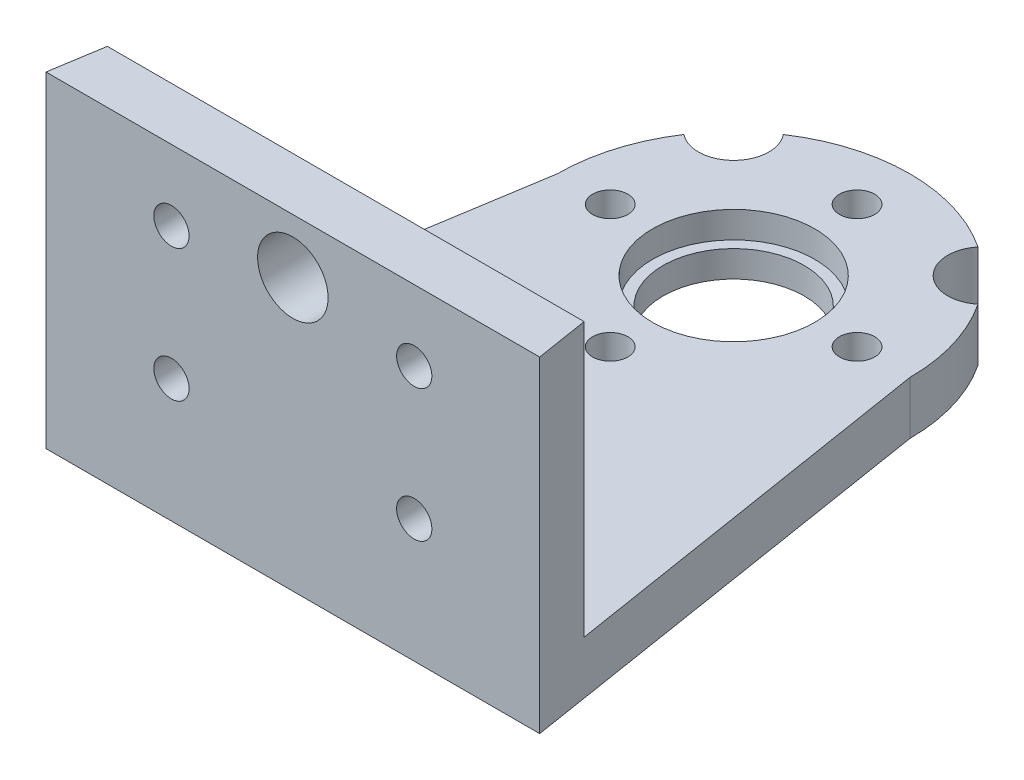
ISO-10303-21;
HEADER;
FILE_DESCRIPTION(('STEP AP214'),'2;1');
FILE_NAME('part.step','',(''),(''),'','','');
FILE_SCHEMA(('AUTOMOTIVE_DESIGN { 1 0 10303 214 1 1 1 1 }'));
ENDSEC;
DATA;
#1=APPLICATION_CONTEXT('core data for automotive mechanical design processes');
#2=APPLICATION_PROTOCOL_DEFINITION('international standard','automotive_design',2000,#1);
#3=PRODUCT_CONTEXT('',#1,'mechanical');
#4=PRODUCT('Part','Part','',(#3));
#5=PRODUCT_RELATED_PRODUCT_CATEGORY('part','',(#4));
#6=PRODUCT_DEFINITION_FORMATION('','',#4);
#7=PRODUCT_DEFINITION_CONTEXT('part definition',#1,'design');
#8=PRODUCT_DEFINITION('design','',#6,#7);
#9=PRODUCT_DEFINITION_SHAPE('','',#8);
#10=(LENGTH_UNIT() NAMED_UNIT(*) SI_UNIT(.MILLI.,.METRE.));
#11=(NAMED_UNIT(*) PLANE_ANGLE_UNIT() SI_UNIT($,.RADIAN.));
#12=(NAMED_UNIT(*) SI_UNIT($,.STERADIAN.) SOLID_ANGLE_UNIT());
#13=UNCERTAINTY_MEASURE_WITH_UNIT(LENGTH_MEASURE(1.E-05),#10,'distance_accuracy_value','');
#14=(GEOMETRIC_REPRESENTATION_CONTEXT(3) GLOBAL_UNCERTAINTY_ASSIGNED_CONTEXT((#13)) GLOBAL_UNIT_ASSIGNED_CONTEXT((#10,
#11,#12)) REPRESENTATION_CONTEXT('',''));
#15=CARTESIAN_POINT('',(0.,0.,0.));
#16=DIRECTION('',(0.,0.,1.));
#17=DIRECTION('',(1.,0.,0.));
#18=AXIS2_PLACEMENT_3D('',#15,#16,#17);
#19=CARTESIAN_POINT('',(0.,3.,0.));
#20=DIRECTION('',(0.,-1.,0.));
#21=DIRECTION('',(0.,0.,-1.));
#22=AXIS2_PLACEMENT_3D('',#19,#20,#21);
#23=CYLINDRICAL_SURFACE('',#22,10.);
#24=CARTESIAN_POINT('',(0.,0.,0.));
#25=DIRECTION('',(0.,1.,0.));
#26=DIRECTION('',(0.,0.,-1.));
#27=AXIS2_PLACEMENT_3D('',#24,#25,#26);
#28=CIRCLE('',#27,10.);
#29=CARTESIAN_POINT('',(10.,0.,0.));
#30=VERTEX_POINT('',#29);
#31=CARTESIAN_POINT('',(8.33677118357518,0.,-5.52252172768116));
#32=VERTEX_POINT('',#31);
#33=EDGE_CURVE('E318',#30,#32,#28,.T.);
#34=ORIENTED_EDGE('',*,*,#33,.T.);
#35=DIRECTION('',(0.,1.,0.));
#36=VECTOR('',#35,1.);
#37=CARTESIAN_POINT('',(8.33677118357519,-2.,-5.52252172768115));
#38=LINE('',#37,#36);
#39=CARTESIAN_POINT('',(8.33677118357519,3.,-5.52252172768115));
#40=VERTEX_POINT('',#39);
#41=EDGE_CURVE('E48',#32,#40,#38,.T.);
#42=ORIENTED_EDGE('',*,*,#41,.T.);
#43=CARTESIAN_POINT('',(0.,3.,0.));
#44=DIRECTION('',(0.,1.,0.));
#45=DIRECTION('',(0.,0.,-1.));
#46=AXIS2_PLACEMENT_3D('',#43,#44,#45);
#47=CIRCLE('',#46,10.);
#48=CARTESIAN_POINT('',(10.,3.,0.));
#49=VERTEX_POINT('',#48);
#50=EDGE_CURVE('E122',#49,#40,#47,.T.);
#51=ORIENTED_EDGE('',*,*,#50,.F.);
#52=DIRECTION('',(0.,-1.,0.));
#53=VECTOR('',#52,1.);
#54=CARTESIAN_POINT('',(10.,3.,0.));
#55=LINE('',#54,#53);
#56=EDGE_CURVE('E146',#49,#30,#55,.T.);
#57=ORIENTED_EDGE('',*,*,#56,.T.);
#58=EDGE_LOOP('',(#34,#42,#51,#57));
#59=FACE_BOUND('',#58,.T.);
#60=ADVANCED_FACE('F34',(#59),#23,.T.);
#61=CARTESIAN_POINT('',(5.52252172768112,3.,-8.33677118357521));
#62=VERTEX_POINT('',#61);
#63=CARTESIAN_POINT('',(-5.52252172768112,3.,-8.33677118357521));
#64=VERTEX_POINT('',#63);
#65=EDGE_CURVE('E119',#62,#64,#47,.T.);
#66=ORIENTED_EDGE('',*,*,#65,.F.);
#67=DIRECTION('',(0.,1.,0.));
#68=VECTOR('',#67,1.);
#69=CARTESIAN_POINT('',(5.52252172768112,-2.,-8.33677118357521));
#70=LINE('',#69,#68);
#71=CARTESIAN_POINT('',(5.52252172768113,0.,-8.3367711835752));
#72=VERTEX_POINT('',#71);
#73=EDGE_CURVE('E109',#62,#72,#70,.F.);
#74=ORIENTED_EDGE('',*,*,#73,.T.);
#75=CARTESIAN_POINT('',(-5.52252172768113,0.,-8.3367711835752));
#76=VERTEX_POINT('',#75);
#77=EDGE_CURVE('E56',#72,#76,#28,.T.);
#78=ORIENTED_EDGE('',*,*,#77,.T.);
#79=DIRECTION('',(0.,1.,0.));
#80=VECTOR('',#79,1.);
#81=CARTESIAN_POINT('',(-5.52252172768112,-2.,-8.33677118357521));
#82=LINE('',#81,#80);
#83=EDGE_CURVE('E126',#76,#64,#82,.T.);
#84=ORIENTED_EDGE('',*,*,#83,.T.);
#85=EDGE_LOOP('',(#66,#74,#78,#84));
#86=FACE_BOUND('',#85,.T.);
#87=ADVANCED_FACE('F125',(#86),#23,.T.);
#88=CARTESIAN_POINT('',(0.,-10.,0.));
#89=DIRECTION('',(0.,1.,0.));
#90=DIRECTION('',(0.,0.,1.));
#91=AXIS2_PLACEMENT_3D('',#88,#89,#90);
#92=CYLINDRICAL_SURFACE('',#91,4.);
#93=CARTESIAN_POINT('',(0.,0.,0.));
#94=DIRECTION('',(0.,-1.,0.));
#95=DIRECTION('',(0.,0.,-1.));
#96=AXIS2_PLACEMENT_3D('',#93,#94,#95);
#97=CIRCLE('',#96,4.);
#98=CARTESIAN_POINT('',(0.,0.,-4.));
#99=VERTEX_POINT('',#98);
#100=EDGE_CURVE('E143',#99,#99,#97,.T.);
#101=ORIENTED_EDGE('',*,*,#100,.T.);
#102=EDGE_LOOP('',(#101));
#103=FACE_BOUND('',#102,.T.);
#104=CARTESIAN_POINT('',(0.,1.5,0.));
#105=DIRECTION('',(0.,1.,0.));
#106=DIRECTION('',(0.,0.,1.));
#107=AXIS2_PLACEMENT_3D('',#104,#105,#106);
#108=CIRCLE('',#107,4.);
#109=CARTESIAN_POINT('',(0.,1.5,4.));
#110=VERTEX_POINT('',#109);
#111=EDGE_CURVE('E152',#110,#110,#108,.F.);
#112=ORIENTED_EDGE('',*,*,#111,.F.);
#113=EDGE_LOOP('',(#112));
#114=FACE_BOUND('',#113,.T.);
#115=ADVANCED_FACE('F191',(#103,#114),#92,.F.);
#116=CARTESIAN_POINT('',(0.,3.,0.));
#117=DIRECTION('',(0.,-1.,0.));
#118=DIRECTION('',(0.,0.,-1.));
#119=AXIS2_PLACEMENT_3D('',#116,#117,#118);
#120=PLANE('',#119);
#121=CARTESIAN_POINT('',(0.,3.,0.));
#122=DIRECTION('',(0.,1.,0.));
#123=DIRECTION('',(0.,0.,1.));
#124=AXIS2_PLACEMENT_3D('',#121,#122,#123);
#125=CIRCLE('',#124,4.6);
#126=CARTESIAN_POINT('',(0.,3.,4.6));
#127=VERTEX_POINT('',#126);
#128=EDGE_CURVE('E258',#127,#127,#125,.T.);
#129=ORIENTED_EDGE('',*,*,#128,.F.);
#130=EDGE_LOOP('',(#129));
#131=FACE_BOUND('',#130,.T.);
#132=CARTESIAN_POINT('',(0.,3.,7.));
#133=DIRECTION('',(0.,1.,0.));
#134=DIRECTION('',(0.,0.,1.));
#135=AXIS2_PLACEMENT_3D('',#132,#133,#134);
#136=CIRCLE('',#135,1.);
#137=CARTESIAN_POINT('',(0.,3.,8.));
#138=VERTEX_POINT('',#137);
#139=EDGE_CURVE('E133',#138,#138,#136,.T.);
#140=ORIENTED_EDGE('',*,*,#139,.F.);
#141=EDGE_LOOP('',(#140));
#142=FACE_BOUND('',#141,.T.);
#143=CARTESIAN_POINT('',(-7.,3.,0.));
#144=DIRECTION('',(0.,1.,0.));
#145=DIRECTION('',(0.,0.,1.));
#146=AXIS2_PLACEMENT_3D('',#143,#144,#145);
#147=CIRCLE('',#146,1.);
#148=CARTESIAN_POINT('',(-7.,3.,0.999999999999975));
#149=VERTEX_POINT('',#148);
#150=EDGE_CURVE('E171',#149,#149,#147,.T.);
#151=ORIENTED_EDGE('',*,*,#150,.F.);
#152=EDGE_LOOP('',(#151));
#153=FACE_BOUND('',#152,.T.);
#154=CARTESIAN_POINT('',(0.,3.,-7.));
#155=DIRECTION('',(0.,1.,0.));
#156=DIRECTION('',(0.,0.,1.));
#157=AXIS2_PLACEMENT_3D('',#154,#155,#156);
#158=CIRCLE('',#157,1.);
#159=CARTESIAN_POINT('',(0.,3.,-6.));
#160=VERTEX_POINT('',#159);
#161=EDGE_CURVE('E163',#160,#160,#158,.T.);
#162=ORIENTED_EDGE('',*,*,#161,.F.);
#163=EDGE_LOOP('',(#162));
#164=FACE_BOUND('',#163,.T.);
#165=CARTESIAN_POINT('',(7.,3.,0.));
#166=DIRECTION('',(0.,1.,0.));
#167=DIRECTION('',(0.,0.,1.));
#168=AXIS2_PLACEMENT_3D('',#165,#166,#167);
#169=CIRCLE('',#168,1.);
#170=CARTESIAN_POINT('',(7.,3.,1.00000000000007));
#171=VERTEX_POINT('',#170);
#172=EDGE_CURVE('E164',#171,#171,#169,.T.);
#173=ORIENTED_EDGE('',*,*,#172,.F.);
#174=EDGE_LOOP('',(#173));
#175=FACE_BOUND('',#174,.T.);
#176=ORIENTED_EDGE('',*,*,#50,.T.);
#177=CARTESIAN_POINT('',(7.07106781186546,3.,-7.07106781186549));
#178=DIRECTION('',(0.,1.,0.));
#179=DIRECTION('',(0.,0.,-1.));
#180=AXIS2_PLACEMENT_3D('',#177,#178,#179);
#181=CIRCLE('',#180,2.);
#182=EDGE_CURVE('E112',#62,#40,#181,.T.);
#183=ORIENTED_EDGE('',*,*,#182,.F.);
#184=ORIENTED_EDGE('',*,*,#65,.T.);
#185=CARTESIAN_POINT('',(-7.07106781186546,3.,-7.07106781186549));
#186=DIRECTION('',(0.,1.,0.));
#187=DIRECTION('',(0.,0.,1.));
#188=AXIS2_PLACEMENT_3D('',#185,#186,#187);
#189=CIRCLE('',#188,2.);
#190=CARTESIAN_POINT('',(-8.33677118357519,3.,-5.52252172768115));
#191=VERTEX_POINT('',#190);
#192=EDGE_CURVE('E240',#191,#64,#189,.T.);
#193=ORIENTED_EDGE('',*,*,#192,.F.);
#194=CARTESIAN_POINT('',(-10.,3.,0.));
#195=VERTEX_POINT('',#194);
#196=EDGE_CURVE('E127',#191,#195,#47,.T.);
#197=ORIENTED_EDGE('',*,*,#196,.T.);
#198=DIRECTION('',(-0.157990501106673,0.,0.987440631916705));
#199=VECTOR('',#198,1.);
#200=CARTESIAN_POINT('',(-10.,3.,0.));
#201=LINE('',#200,#199);
#202=CARTESIAN_POINT('',(-13.52,3.,22.));
#203=VERTEX_POINT('',#202);
#204=EDGE_CURVE('E129',#195,#203,#201,.T.);
#205=ORIENTED_EDGE('',*,*,#204,.T.);
#206=DIRECTION('',(-1.,0.,0.));
#207=VECTOR('',#206,1.);
#208=CARTESIAN_POINT('',(-13.52,3.,22.));
#209=LINE('',#208,#207);
#210=CARTESIAN_POINT('',(13.52,3.,22.));
#211=VERTEX_POINT('',#210);
#212=EDGE_CURVE('E147',#211,#203,#209,.T.);
#213=ORIENTED_EDGE('',*,*,#212,.F.);
#214=DIRECTION('',(-0.157990501106673,0.,-0.987440631916705));
#215=VECTOR('',#214,1.);
#216=CARTESIAN_POINT('',(10.,3.,0.));
#217=LINE('',#216,#215);
#218=EDGE_CURVE('E142',#211,#49,#217,.T.);
#219=ORIENTED_EDGE('',*,*,#218,.T.);
#220=EDGE_LOOP('',(#176,#183,#184,#193,#197,#205,#213,#219));
#221=FACE_BOUND('',#220,.T.);
#222=ADVANCED_FACE('F117',(#131,#142,#153,#164,#175,#221),#120,.F.);
#223=ORIENTED_EDGE('',*,*,#196,.F.);
#224=DIRECTION('',(0.,1.,0.));
#225=VECTOR('',#224,1.);
#226=CARTESIAN_POINT('',(-8.33677118357519,-2.,-5.52252172768115));
#227=LINE('',#226,#225);
#228=CARTESIAN_POINT('',(-8.33677118357518,0.,-5.52252172768116));
#229=VERTEX_POINT('',#228);
#230=EDGE_CURVE('E235',#191,#229,#227,.F.);
#231=ORIENTED_EDGE('',*,*,#230,.T.);
#232=CARTESIAN_POINT('',(-10.,0.,0.));
#233=VERTEX_POINT('',#232);
#234=EDGE_CURVE('E183',#229,#233,#28,.T.);
#235=ORIENTED_EDGE('',*,*,#234,.T.);
#236=DIRECTION('',(0.,-1.,0.));
#237=VECTOR('',#236,1.);
#238=CARTESIAN_POINT('',(-10.,3.,0.));
#239=LINE('',#238,#237);
#240=EDGE_CURVE('E238',#195,#233,#239,.T.);
#241=ORIENTED_EDGE('',*,*,#240,.F.);
#242=EDGE_LOOP('',(#223,#231,#235,#241));
#243=FACE_BOUND('',#242,.T.);
#244=ADVANCED_FACE('F36',(#243),#23,.T.);
#245=CARTESIAN_POINT('',(-10.,3.,0.));
#246=DIRECTION('',(0.987440631916705,0.,0.157990501106673));
#247=DIRECTION('',(0.157990501106673,0.,-0.987440631916705));
#248=AXIS2_PLACEMENT_3D('',#245,#246,#247);
#249=PLANE('',#248);
#250=DIRECTION('',(-0.157990501106673,0.,0.987440631916705));
#251=VECTOR('',#250,1.);
#252=CARTESIAN_POINT('',(-10.,0.,0.));
#253=LINE('',#252,#251);
#254=CARTESIAN_POINT('',(-14.,0.,25.));
#255=VERTEX_POINT('',#254);
#256=EDGE_CURVE('E320',#233,#255,#253,.T.);
#257=ORIENTED_EDGE('',*,*,#256,.T.);
#258=DIRECTION('',(0.,-1.,0.));
#259=VECTOR('',#258,1.);
#260=CARTESIAN_POINT('',(-14.,3.,25.));
#261=LINE('',#260,#259);
#262=CARTESIAN_POINT('',(-14.,18.5,25.));
#263=VERTEX_POINT('',#262);
#264=EDGE_CURVE('E329',#263,#255,#261,.T.);
#265=ORIENTED_EDGE('',*,*,#264,.F.);
#266=DIRECTION('',(-0.157990501106673,0.,0.987440631916705));
#267=VECTOR('',#266,1.);
#268=CARTESIAN_POINT('',(-13.52,18.5,22.));
#269=LINE('',#268,#267);
#270=CARTESIAN_POINT('',(-13.52,18.5,22.));
#271=VERTEX_POINT('',#270);
#272=EDGE_CURVE('E151',#271,#263,#269,.T.);
#273=ORIENTED_EDGE('',*,*,#272,.F.);
#274=DIRECTION('',(0.,-1.,0.));
#275=VECTOR('',#274,1.);
#276=CARTESIAN_POINT('',(-13.52,18.5,22.));
#277=LINE('',#276,#275);
#278=EDGE_CURVE('E153',#271,#203,#277,.T.);
#279=ORIENTED_EDGE('',*,*,#278,.T.);
#280=ORIENTED_EDGE('',*,*,#204,.F.);
#281=ORIENTED_EDGE('',*,*,#240,.T.);
#282=EDGE_LOOP('',(#257,#265,#273,#279,#280,#281));
#283=FACE_BOUND('',#282,.T.);
#284=ADVANCED_FACE('F225',(#283),#249,.F.);
#285=CARTESIAN_POINT('',(-14.,3.,25.));
#286=DIRECTION('',(0.,0.,-1.));
#287=DIRECTION('',(-1.,0.,0.));
#288=AXIS2_PLACEMENT_3D('',#285,#286,#287);
#289=PLANE('',#288);
#290=CARTESIAN_POINT('',(-1.49508972665386E-13,15.4000000000021,25.));
#291=DIRECTION('',(0.,0.,-1.));
#292=DIRECTION('',(-1.,0.,0.));
#293=AXIS2_PLACEMENT_3D('',#290,#291,#292);
#294=CIRCLE('',#293,2.);
#295=CARTESIAN_POINT('',(-2.00000000000015,15.4000000000021,25.));
#296=VERTEX_POINT('',#295);
#297=EDGE_CURVE('E287',#296,#296,#294,.T.);
#298=ORIENTED_EDGE('',*,*,#297,.T.);
#299=EDGE_LOOP('',(#298));
#300=FACE_BOUND('',#299,.T.);
#301=CARTESIAN_POINT('',(6.88499999999998,7.,25.));
#302=DIRECTION('',(0.,0.,-1.));
#303=DIRECTION('',(-1.,0.,0.));
#304=AXIS2_PLACEMENT_3D('',#301,#302,#303);
#305=CIRCLE('',#304,1.);
#306=CARTESIAN_POINT('',(5.88499999999998,7.,25.));
#307=VERTEX_POINT('',#306);
#308=EDGE_CURVE('E273',#307,#307,#305,.T.);
#309=ORIENTED_EDGE('',*,*,#308,.T.);
#310=EDGE_LOOP('',(#309));
#311=FACE_BOUND('',#310,.T.);
#312=CARTESIAN_POINT('',(-6.88499999999999,14.5,25.));
#313=DIRECTION('',(0.,0.,-1.));
#314=DIRECTION('',(-1.,0.,0.));
#315=AXIS2_PLACEMENT_3D('',#312,#313,#314);
#316=CIRCLE('',#315,1.);
#317=CARTESIAN_POINT('',(-7.885,14.5,25.));
#318=VERTEX_POINT('',#317);
#319=EDGE_CURVE('E276',#318,#318,#316,.T.);
#320=ORIENTED_EDGE('',*,*,#319,.T.);
#321=EDGE_LOOP('',(#320));
#322=FACE_BOUND('',#321,.T.);
#323=CARTESIAN_POINT('',(6.88500000000001,14.5,25.));
#324=DIRECTION('',(0.,0.,-1.));
#325=DIRECTION('',(-1.,0.,0.));
#326=AXIS2_PLACEMENT_3D('',#323,#324,#325);
#327=CIRCLE('',#326,1.);
#328=CARTESIAN_POINT('',(5.88500000000001,14.5,25.));
#329=VERTEX_POINT('',#328);
#330=EDGE_CURVE('E279',#329,#329,#327,.T.);
#331=ORIENTED_EDGE('',*,*,#330,.T.);
#332=EDGE_LOOP('',(#331));
#333=FACE_BOUND('',#332,.T.);
#334=CARTESIAN_POINT('',(-6.88500000000002,7.,25.));
#335=DIRECTION('',(0.,0.,-1.));
#336=DIRECTION('',(-1.,0.,0.));
#337=AXIS2_PLACEMENT_3D('',#334,#335,#336);
#338=CIRCLE('',#337,1.);
#339=CARTESIAN_POINT('',(-7.88500000000002,7.,25.));
#340=VERTEX_POINT('',#339);
#341=EDGE_CURVE('E123',#340,#340,#338,.T.);
#342=ORIENTED_EDGE('',*,*,#341,.T.);
#343=EDGE_LOOP('',(#342));
#344=FACE_BOUND('',#343,.T.);
#345=DIRECTION('',(1.,0.,0.));
#346=VECTOR('',#345,1.);
#347=CARTESIAN_POINT('',(-14.,0.,25.));
#348=LINE('',#347,#346);
#349=CARTESIAN_POINT('',(14.,0.,25.));
#350=VERTEX_POINT('',#349);
#351=EDGE_CURVE('E321',#255,#350,#348,.T.);
#352=ORIENTED_EDGE('',*,*,#351,.T.);
#353=DIRECTION('',(0.,-1.,0.));
#354=VECTOR('',#353,1.);
#355=CARTESIAN_POINT('',(14.,3.,25.));
#356=LINE('',#355,#354);
#357=CARTESIAN_POINT('',(14.,18.5,25.));
#358=VERTEX_POINT('',#357);
#359=EDGE_CURVE('E316',#358,#350,#356,.T.);
#360=ORIENTED_EDGE('',*,*,#359,.F.);
#361=DIRECTION('',(1.,0.,0.));
#362=VECTOR('',#361,1.);
#363=CARTESIAN_POINT('',(-14.,18.5,25.));
#364=LINE('',#363,#362);
#365=EDGE_CURVE('E251',#263,#358,#364,.T.);
#366=ORIENTED_EDGE('',*,*,#365,.F.);
#367=ORIENTED_EDGE('',*,*,#264,.T.);
#368=EDGE_LOOP('',(#352,#360,#366,#367));
#369=FACE_BOUND('',#368,.T.);
#370=ADVANCED_FACE('F230',(#300,#311,#322,#333,#344,#369),#289,.F.);
#371=CARTESIAN_POINT('',(10.,3.,0.));
#372=DIRECTION('',(-0.987440631916705,0.,0.157990501106673));
#373=DIRECTION('',(0.157990501106673,0.,0.987440631916705));
#374=AXIS2_PLACEMENT_3D('',#371,#372,#373);
#375=PLANE('',#374);
#376=DIRECTION('',(-0.157990501106673,0.,-0.987440631916705));
#377=VECTOR('',#376,1.);
#378=CARTESIAN_POINT('',(10.,0.,0.));
#379=LINE('',#378,#377);
#380=EDGE_CURVE('E130',#350,#30,#379,.T.);
#381=ORIENTED_EDGE('',*,*,#380,.T.);
#382=ORIENTED_EDGE('',*,*,#56,.F.);
#383=ORIENTED_EDGE('',*,*,#218,.F.);
#384=DIRECTION('',(0.,-1.,0.));
#385=VECTOR('',#384,1.);
#386=CARTESIAN_POINT('',(13.52,18.5,22.));
#387=LINE('',#386,#385);
#388=CARTESIAN_POINT('',(13.52,18.5,22.));
#389=VERTEX_POINT('',#388);
#390=EDGE_CURVE('E167',#389,#211,#387,.T.);
#391=ORIENTED_EDGE('',*,*,#390,.F.);
#392=DIRECTION('',(-0.157990501106673,0.,-0.987440631916705));
#393=VECTOR('',#392,1.);
#394=CARTESIAN_POINT('',(14.,18.5,25.));
#395=LINE('',#394,#393);
#396=EDGE_CURVE('E249',#358,#389,#395,.T.);
#397=ORIENTED_EDGE('',*,*,#396,.F.);
#398=ORIENTED_EDGE('',*,*,#359,.T.);
#399=EDGE_LOOP('',(#381,#382,#383,#391,#397,#398));
#400=FACE_BOUND('',#399,.T.);
#401=ADVANCED_FACE('F311',(#400),#375,.F.);
#402=CARTESIAN_POINT('',(0.,0.,0.));
#403=DIRECTION('',(0.,-1.,0.));
#404=DIRECTION('',(0.,0.,-1.));
#405=AXIS2_PLACEMENT_3D('',#402,#403,#404);
#406=PLANE('',#405);
#407=CARTESIAN_POINT('',(7.07106781186546,0.,-7.07106781186549));
#408=DIRECTION('',(0.,-1.,0.));
#409=DIRECTION('',(0.,0.,-1.));
#410=AXIS2_PLACEMENT_3D('',#407,#408,#409);
#411=CIRCLE('',#410,2.);
#412=EDGE_CURVE('E11',#32,#72,#411,.T.);
#413=ORIENTED_EDGE('',*,*,#412,.F.);
#414=ORIENTED_EDGE('',*,*,#33,.F.);
#415=ORIENTED_EDGE('',*,*,#380,.F.);
#416=ORIENTED_EDGE('',*,*,#351,.F.);
#417=ORIENTED_EDGE('',*,*,#256,.F.);
#418=ORIENTED_EDGE('',*,*,#234,.F.);
#419=CARTESIAN_POINT('',(-7.07106781186546,0.,-7.07106781186549));
#420=DIRECTION('',(0.,-1.,0.));
#421=DIRECTION('',(0.,0.,-1.));
#422=AXIS2_PLACEMENT_3D('',#419,#420,#421);
#423=CIRCLE('',#422,2.);
#424=EDGE_CURVE('E42',#76,#229,#423,.T.);
#425=ORIENTED_EDGE('',*,*,#424,.F.);
#426=ORIENTED_EDGE('',*,*,#77,.F.);
#427=EDGE_LOOP('',(#413,#414,#415,#416,#417,#418,#425,#426));
#428=FACE_BOUND('',#427,.T.);
#429=CARTESIAN_POINT('',(7.,0.,0.));
#430=DIRECTION('',(0.,1.,0.));
#431=DIRECTION('',(0.,0.,1.));
#432=AXIS2_PLACEMENT_3D('',#429,#430,#431);
#433=CIRCLE('',#432,1.);
#434=CARTESIAN_POINT('',(7.,0.,1.00000000000007));
#435=VERTEX_POINT('',#434);
#436=EDGE_CURVE('E160',#435,#435,#433,.T.);
#437=ORIENTED_EDGE('',*,*,#436,.T.);
#438=EDGE_LOOP('',(#437));
#439=FACE_BOUND('',#438,.T.);
#440=CARTESIAN_POINT('',(0.,0.,-7.));
#441=DIRECTION('',(0.,1.,0.));
#442=DIRECTION('',(0.,0.,1.));
#443=AXIS2_PLACEMENT_3D('',#440,#441,#442);
#444=CIRCLE('',#443,1.);
#445=CARTESIAN_POINT('',(0.,0.,-6.));
#446=VERTEX_POINT('',#445);
#447=EDGE_CURVE('E168',#446,#446,#444,.T.);
#448=ORIENTED_EDGE('',*,*,#447,.T.);
#449=EDGE_LOOP('',(#448));
#450=FACE_BOUND('',#449,.T.);
#451=CARTESIAN_POINT('',(-7.,0.,0.));
#452=DIRECTION('',(0.,1.,0.));
#453=DIRECTION('',(0.,0.,1.));
#454=AXIS2_PLACEMENT_3D('',#451,#452,#453);
#455=CIRCLE('',#454,1.);
#456=CARTESIAN_POINT('',(-7.,0.,0.999999999999975));
#457=VERTEX_POINT('',#456);
#458=EDGE_CURVE('E174',#457,#457,#455,.T.);
#459=ORIENTED_EDGE('',*,*,#458,.T.);
#460=EDGE_LOOP('',(#459));
#461=FACE_BOUND('',#460,.T.);
#462=CARTESIAN_POINT('',(0.,0.,7.));
#463=DIRECTION('',(0.,1.,0.));
#464=DIRECTION('',(0.,0.,1.));
#465=AXIS2_PLACEMENT_3D('',#462,#463,#464);
#466=CIRCLE('',#465,1.);
#467=CARTESIAN_POINT('',(0.,0.,8.));
#468=VERTEX_POINT('',#467);
#469=EDGE_CURVE('E178',#468,#468,#466,.T.);
#470=ORIENTED_EDGE('',*,*,#469,.T.);
#471=EDGE_LOOP('',(#470));
#472=FACE_BOUND('',#471,.T.);
#473=ORIENTED_EDGE('',*,*,#100,.F.);
#474=EDGE_LOOP('',(#473));
#475=FACE_BOUND('',#474,.T.);
#476=ADVANCED_FACE('F326',(#428,#439,#450,#461,#472,#475),#406,.T.);
#477=CARTESIAN_POINT('',(0.,0.,7.));
#478=DIRECTION('',(0.,1.,0.));
#479=DIRECTION('',(0.,0.,1.));
#480=AXIS2_PLACEMENT_3D('',#477,#478,#479);
#481=CYLINDRICAL_SURFACE('',#480,1.);
#482=ORIENTED_EDGE('',*,*,#469,.F.);
#483=EDGE_LOOP('',(#482));
#484=FACE_BOUND('',#483,.T.);
#485=ORIENTED_EDGE('',*,*,#139,.T.);
#486=EDGE_LOOP('',(#485));
#487=FACE_BOUND('',#486,.T.);
#488=ADVANCED_FACE('F187',(#484,#487),#481,.F.);
#489=CARTESIAN_POINT('',(-7.,0.,0.));
#490=DIRECTION('',(0.,1.,0.));
#491=DIRECTION('',(0.,0.,1.));
#492=AXIS2_PLACEMENT_3D('',#489,#490,#491);
#493=CYLINDRICAL_SURFACE('',#492,1.);
#494=ORIENTED_EDGE('',*,*,#458,.F.);
#495=EDGE_LOOP('',(#494));
#496=FACE_BOUND('',#495,.T.);
#497=ORIENTED_EDGE('',*,*,#150,.T.);
#498=EDGE_LOOP('',(#497));
#499=FACE_BOUND('',#498,.T.);
#500=ADVANCED_FACE('F214',(#496,#499),#493,.F.);
#501=CARTESIAN_POINT('',(0.,0.,-7.));
#502=DIRECTION('',(0.,1.,0.));
#503=DIRECTION('',(0.,0.,1.));
#504=AXIS2_PLACEMENT_3D('',#501,#502,#503);
#505=CYLINDRICAL_SURFACE('',#504,1.);
#506=ORIENTED_EDGE('',*,*,#447,.F.);
#507=EDGE_LOOP('',(#506));
#508=FACE_BOUND('',#507,.T.);
#509=ORIENTED_EDGE('',*,*,#161,.T.);
#510=EDGE_LOOP('',(#509));
#511=FACE_BOUND('',#510,.T.);
#512=ADVANCED_FACE('F203',(#508,#511),#505,.F.);
#513=CARTESIAN_POINT('',(7.,0.,0.));
#514=DIRECTION('',(0.,1.,0.));
#515=DIRECTION('',(0.,0.,1.));
#516=AXIS2_PLACEMENT_3D('',#513,#514,#515);
#517=CYLINDRICAL_SURFACE('',#516,1.);
#518=ORIENTED_EDGE('',*,*,#436,.F.);
#519=EDGE_LOOP('',(#518));
#520=FACE_BOUND('',#519,.T.);
#521=ORIENTED_EDGE('',*,*,#172,.T.);
#522=EDGE_LOOP('',(#521));
#523=FACE_BOUND('',#522,.T.);
#524=ADVANCED_FACE('F200',(#520,#523),#517,.F.);
#525=CARTESIAN_POINT('',(-13.52,18.5,22.));
#526=DIRECTION('',(0.,0.,1.));
#527=DIRECTION('',(1.,0.,0.));
#528=AXIS2_PLACEMENT_3D('',#525,#526,#527);
#529=PLANE('',#528);
#530=CARTESIAN_POINT('',(-1.49508972665386E-13,15.4000000000021,22.));
#531=DIRECTION('',(0.,0.,-1.));
#532=DIRECTION('',(-1.,0.,0.));
#533=AXIS2_PLACEMENT_3D('',#530,#531,#532);
#534=CIRCLE('',#533,2.);
#535=CARTESIAN_POINT('',(-2.00000000000015,15.4000000000021,22.));
#536=VERTEX_POINT('',#535);
#537=EDGE_CURVE('E294',#536,#536,#534,.T.);
#538=ORIENTED_EDGE('',*,*,#537,.F.);
#539=EDGE_LOOP('',(#538));
#540=FACE_BOUND('',#539,.T.);
#541=CARTESIAN_POINT('',(6.88499999999998,7.,22.));
#542=DIRECTION('',(0.,0.,-1.));
#543=DIRECTION('',(-1.,0.,0.));
#544=AXIS2_PLACEMENT_3D('',#541,#542,#543);
#545=CIRCLE('',#544,1.);
#546=CARTESIAN_POINT('',(5.88499999999998,7.,22.));
#547=VERTEX_POINT('',#546);
#548=EDGE_CURVE('E282',#547,#547,#545,.T.);
#549=ORIENTED_EDGE('',*,*,#548,.F.);
#550=EDGE_LOOP('',(#549));
#551=FACE_BOUND('',#550,.T.);
#552=CARTESIAN_POINT('',(-6.88499999999999,14.5,22.));
#553=DIRECTION('',(0.,0.,-1.));
#554=DIRECTION('',(-1.,0.,0.));
#555=AXIS2_PLACEMENT_3D('',#552,#553,#554);
#556=CIRCLE('',#555,1.);
#557=CARTESIAN_POINT('',(-7.885,14.5,22.));
#558=VERTEX_POINT('',#557);
#559=EDGE_CURVE('E286',#558,#558,#556,.T.);
#560=ORIENTED_EDGE('',*,*,#559,.F.);
#561=EDGE_LOOP('',(#560));
#562=FACE_BOUND('',#561,.T.);
#563=CARTESIAN_POINT('',(6.88500000000001,14.5,22.));
#564=DIRECTION('',(0.,0.,-1.));
#565=DIRECTION('',(-1.,0.,0.));
#566=AXIS2_PLACEMENT_3D('',#563,#564,#565);
#567=CIRCLE('',#566,1.);
#568=CARTESIAN_POINT('',(5.88500000000001,14.5,22.));
#569=VERTEX_POINT('',#568);
#570=EDGE_CURVE('E283',#569,#569,#567,.T.);
#571=ORIENTED_EDGE('',*,*,#570,.F.);
#572=EDGE_LOOP('',(#571));
#573=FACE_BOUND('',#572,.T.);
#574=CARTESIAN_POINT('',(-6.88500000000002,7.,22.));
#575=DIRECTION('',(0.,0.,-1.));
#576=DIRECTION('',(-1.,0.,0.));
#577=AXIS2_PLACEMENT_3D('',#574,#575,#576);
#578=CIRCLE('',#577,1.);
#579=CARTESIAN_POINT('',(-7.88500000000002,7.,22.));
#580=VERTEX_POINT('',#579);
#581=EDGE_CURVE('E270',#580,#580,#578,.T.);
#582=ORIENTED_EDGE('',*,*,#581,.F.);
#583=EDGE_LOOP('',(#582));
#584=FACE_BOUND('',#583,.T.);
#585=ORIENTED_EDGE('',*,*,#212,.T.);
#586=ORIENTED_EDGE('',*,*,#278,.F.);
#587=DIRECTION('',(-1.,0.,0.));
#588=VECTOR('',#587,1.);
#589=CARTESIAN_POINT('',(-13.52,18.5,22.));
#590=LINE('',#589,#588);
#591=EDGE_CURVE('E158',#389,#271,#590,.T.);
#592=ORIENTED_EDGE('',*,*,#591,.F.);
#593=ORIENTED_EDGE('',*,*,#390,.T.);
#594=EDGE_LOOP('',(#585,#586,#592,#593));
#595=FACE_BOUND('',#594,.T.);
#596=ADVANCED_FACE('F202',(#540,#551,#562,#573,#584,#595),#529,.F.);
#597=CARTESIAN_POINT('',(0.,18.5,0.));
#598=DIRECTION('',(0.,1.,0.));
#599=DIRECTION('',(0.,0.,1.));
#600=AXIS2_PLACEMENT_3D('',#597,#598,#599);
#601=PLANE('',#600);
#602=ORIENTED_EDGE('',*,*,#272,.T.);
#603=ORIENTED_EDGE('',*,*,#365,.T.);
#604=ORIENTED_EDGE('',*,*,#396,.T.);
#605=ORIENTED_EDGE('',*,*,#591,.T.);
#606=EDGE_LOOP('',(#602,#603,#604,#605));
#607=FACE_BOUND('',#606,.T.);
#608=ADVANCED_FACE('F211',(#607),#601,.T.);
#609=CARTESIAN_POINT('',(0.,1.5,0.));
#610=DIRECTION('',(0.,1.,0.));
#611=DIRECTION('',(0.,0.,1.));
#612=AXIS2_PLACEMENT_3D('',#609,#610,#611);
#613=PLANE('',#612);
#614=CARTESIAN_POINT('',(0.,1.5,0.));
#615=DIRECTION('',(0.,1.,0.));
#616=DIRECTION('',(0.,0.,1.));
#617=AXIS2_PLACEMENT_3D('',#614,#615,#616);
#618=CIRCLE('',#617,4.6);
#619=CARTESIAN_POINT('',(0.,1.5,4.6));
#620=VERTEX_POINT('',#619);
#621=EDGE_CURVE('E261',#620,#620,#618,.T.);
#622=ORIENTED_EDGE('',*,*,#621,.T.);
#623=EDGE_LOOP('',(#622));
#624=FACE_BOUND('',#623,.T.);
#625=ORIENTED_EDGE('',*,*,#111,.T.);
#626=EDGE_LOOP('',(#625));
#627=FACE_BOUND('',#626,.T.);
#628=ADVANCED_FACE('F337',(#624,#627),#613,.T.);
#629=CARTESIAN_POINT('',(0.,1.5,0.));
#630=DIRECTION('',(0.,1.,0.));
#631=DIRECTION('',(0.,0.,1.));
#632=AXIS2_PLACEMENT_3D('',#629,#630,#631);
#633=CYLINDRICAL_SURFACE('',#632,4.6);
#634=ORIENTED_EDGE('',*,*,#621,.F.);
#635=EDGE_LOOP('',(#634));
#636=FACE_BOUND('',#635,.T.);
#637=ORIENTED_EDGE('',*,*,#128,.T.);
#638=EDGE_LOOP('',(#637));
#639=FACE_BOUND('',#638,.T.);
#640=ADVANCED_FACE('F342',(#636,#639),#633,.F.);
#641=CARTESIAN_POINT('',(-7.07106781186546,-7.,-7.07106781186549));
#642=DIRECTION('',(0.,1.,0.));
#643=DIRECTION('',(0.,0.,1.));
#644=AXIS2_PLACEMENT_3D('',#641,#642,#643);
#645=CYLINDRICAL_SURFACE('',#644,2.);
#646=ORIENTED_EDGE('',*,*,#424,.T.);
#647=ORIENTED_EDGE('',*,*,#230,.F.);
#648=ORIENTED_EDGE('',*,*,#192,.T.);
#649=ORIENTED_EDGE('',*,*,#83,.F.);
#650=EDGE_LOOP('',(#646,#647,#648,#649));
#651=FACE_BOUND('',#650,.T.);
#652=ADVANCED_FACE('F347',(#651),#645,.F.);
#653=CARTESIAN_POINT('',(7.07106781186546,-7.,-7.07106781186549));
#654=DIRECTION('',(0.,1.,0.));
#655=DIRECTION('',(0.,0.,1.));
#656=AXIS2_PLACEMENT_3D('',#653,#654,#655);
#657=CYLINDRICAL_SURFACE('',#656,2.);
#658=ORIENTED_EDGE('',*,*,#412,.T.);
#659=ORIENTED_EDGE('',*,*,#73,.F.);
#660=ORIENTED_EDGE('',*,*,#182,.T.);
#661=ORIENTED_EDGE('',*,*,#41,.F.);
#662=EDGE_LOOP('',(#658,#659,#660,#661));
#663=FACE_BOUND('',#662,.T.);
#664=ADVANCED_FACE('F111',(#663),#657,.F.);
#665=CARTESIAN_POINT('',(-6.88500000000002,7.,32.));
#666=DIRECTION('',(0.,0.,-1.));
#667=DIRECTION('',(-1.,0.,0.));
#668=AXIS2_PLACEMENT_3D('',#665,#666,#667);
#669=CYLINDRICAL_SURFACE('',#668,1.);
#670=ORIENTED_EDGE('',*,*,#581,.T.);
#671=EDGE_LOOP('',(#670));
#672=FACE_BOUND('',#671,.T.);
#673=ORIENTED_EDGE('',*,*,#341,.F.);
#674=EDGE_LOOP('',(#673));
#675=FACE_BOUND('',#674,.T.);
#676=ADVANCED_FACE('F355',(#672,#675),#669,.F.);
#677=CARTESIAN_POINT('',(6.88500000000001,14.5,32.));
#678=DIRECTION('',(0.,0.,-1.));
#679=DIRECTION('',(-1.,0.,0.));
#680=AXIS2_PLACEMENT_3D('',#677,#678,#679);
#681=CYLINDRICAL_SURFACE('',#680,1.);
#682=ORIENTED_EDGE('',*,*,#570,.T.);
#683=EDGE_LOOP('',(#682));
#684=FACE_BOUND('',#683,.T.);
#685=ORIENTED_EDGE('',*,*,#330,.F.);
#686=EDGE_LOOP('',(#685));
#687=FACE_BOUND('',#686,.T.);
#688=ADVANCED_FACE('F358',(#684,#687),#681,.F.);
#689=CARTESIAN_POINT('',(-6.88499999999999,14.5,32.));
#690=DIRECTION('',(0.,0.,-1.));
#691=DIRECTION('',(-1.,0.,0.));
#692=AXIS2_PLACEMENT_3D('',#689,#690,#691);
#693=CYLINDRICAL_SURFACE('',#692,1.);
#694=ORIENTED_EDGE('',*,*,#559,.T.);
#695=EDGE_LOOP('',(#694));
#696=FACE_BOUND('',#695,.T.);
#697=ORIENTED_EDGE('',*,*,#319,.F.);
#698=EDGE_LOOP('',(#697));
#699=FACE_BOUND('',#698,.T.);
#700=ADVANCED_FACE('F362',(#696,#699),#693,.F.);
#701=CARTESIAN_POINT('',(6.88499999999998,7.,32.));
#702=DIRECTION('',(0.,0.,-1.));
#703=DIRECTION('',(-1.,0.,0.));
#704=AXIS2_PLACEMENT_3D('',#701,#702,#703);
#705=CYLINDRICAL_SURFACE('',#704,1.);
#706=ORIENTED_EDGE('',*,*,#548,.T.);
#707=EDGE_LOOP('',(#706));
#708=FACE_BOUND('',#707,.T.);
#709=ORIENTED_EDGE('',*,*,#308,.F.);
#710=EDGE_LOOP('',(#709));
#711=FACE_BOUND('',#710,.T.);
#712=ADVANCED_FACE('F366',(#708,#711),#705,.F.);
#713=CARTESIAN_POINT('',(-1.49508972665386E-13,15.4000000000021,32.));
#714=DIRECTION('',(0.,0.,-1.));
#715=DIRECTION('',(-1.,0.,0.));
#716=AXIS2_PLACEMENT_3D('',#713,#714,#715);
#717=CYLINDRICAL_SURFACE('',#716,2.);
#718=ORIENTED_EDGE('',*,*,#537,.T.);
#719=EDGE_LOOP('',(#718));
#720=FACE_BOUND('',#719,.T.);
#721=ORIENTED_EDGE('',*,*,#297,.F.);
#722=EDGE_LOOP('',(#721));
#723=FACE_BOUND('',#722,.T.);
#724=ADVANCED_FACE('F298',(#720,#723),#717,.F.);
#725=CLOSED_SHELL('',(#60,#87,#115,#222,#244,#284,#370,#401,#476,#488,#500,#512,#524,#596,#608,
#628,#640,#652,#664,#676,#688,#700,#712,#724));
#726=MANIFOLD_SOLID_BREP('B2',#725);
#727=ADVANCED_BREP_SHAPE_REPRESENTATION('',(#18,#726),#14);
#728=SHAPE_DEFINITION_REPRESENTATION(#9,#727);
ENDSEC;
END-ISO-10303-21;
